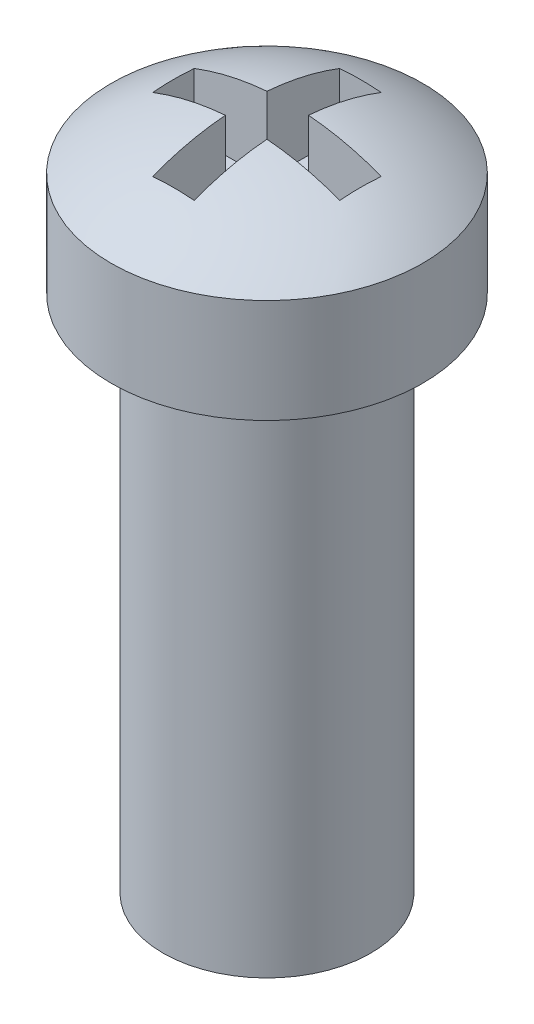
ISO-10303-21;
HEADER;
FILE_DESCRIPTION(('STEP AP214'),'2;1');
FILE_NAME('part.step','',(''),(''),'','','');
FILE_SCHEMA(('AUTOMOTIVE_DESIGN { 1 0 10303 214 1 1 1 1 }'));
ENDSEC;
DATA;
#1=APPLICATION_CONTEXT('core data for automotive mechanical design processes');
#2=APPLICATION_PROTOCOL_DEFINITION('international standard','automotive_design',2000,#1);
#3=PRODUCT_CONTEXT('',#1,'mechanical');
#4=PRODUCT('Part','Part','',(#3));
#5=PRODUCT_RELATED_PRODUCT_CATEGORY('part','',(#4));
#6=PRODUCT_DEFINITION_FORMATION('','',#4);
#7=PRODUCT_DEFINITION_CONTEXT('part definition',#1,'design');
#8=PRODUCT_DEFINITION('design','',#6,#7);
#9=PRODUCT_DEFINITION_SHAPE('','',#8);
#10=(LENGTH_UNIT() NAMED_UNIT(*) SI_UNIT(.MILLI.,.METRE.));
#11=(NAMED_UNIT(*) PLANE_ANGLE_UNIT() SI_UNIT($,.RADIAN.));
#12=(NAMED_UNIT(*) SI_UNIT($,.STERADIAN.) SOLID_ANGLE_UNIT());
#13=UNCERTAINTY_MEASURE_WITH_UNIT(LENGTH_MEASURE(1.E-05),#10,'distance_accuracy_value','');
#14=(GEOMETRIC_REPRESENTATION_CONTEXT(3) GLOBAL_UNCERTAINTY_ASSIGNED_CONTEXT((#13)) GLOBAL_UNIT_ASSIGNED_CONTEXT((#10,
#11,#12)) REPRESENTATION_CONTEXT('',''));
#15=CARTESIAN_POINT('',(0.,0.,0.));
#16=DIRECTION('',(0.,0.,1.));
#17=DIRECTION('',(1.,0.,0.));
#18=AXIS2_PLACEMENT_3D('',#15,#16,#17);
#19=CARTESIAN_POINT('',(0.,5.,0.));
#20=DIRECTION('',(0.,-1.,0.));
#21=DIRECTION('',(0.,0.,-1.));
#22=AXIS2_PLACEMENT_3D('',#19,#20,#21);
#23=CYLINDRICAL_SURFACE('',#22,1.);
#24=CARTESIAN_POINT('',(0.,5.,0.));
#25=DIRECTION('',(0.,1.,0.));
#26=DIRECTION('',(0.,0.,1.));
#27=AXIS2_PLACEMENT_3D('',#24,#25,#26);
#28=CIRCLE('',#27,1.);
#29=CARTESIAN_POINT('',(0.,5.,1.));
#30=VERTEX_POINT('',#29);
#31=EDGE_CURVE('E197',#30,#30,#28,.T.);
#32=ORIENTED_EDGE('',*,*,#31,.F.);
#33=EDGE_LOOP('',(#32));
#34=FACE_BOUND('',#33,.T.);
#35=CARTESIAN_POINT('',(0.,0.,0.));
#36=DIRECTION('',(0.,1.,0.));
#37=DIRECTION('',(0.,0.,1.));
#38=AXIS2_PLACEMENT_3D('',#35,#36,#37);
#39=CIRCLE('',#38,1.);
#40=CARTESIAN_POINT('',(0.,0.,1.));
#41=VERTEX_POINT('',#40);
#42=EDGE_CURVE('E201',#41,#41,#39,.T.);
#43=ORIENTED_EDGE('',*,*,#42,.T.);
#44=EDGE_LOOP('',(#43));
#45=FACE_BOUND('',#44,.T.);
#46=ADVANCED_FACE('F34',(#34,#45),#23,.T.);
#47=CARTESIAN_POINT('',(0.,0.,0.));
#48=DIRECTION('',(0.,1.,0.));
#49=DIRECTION('',(0.,0.,1.));
#50=AXIS2_PLACEMENT_3D('',#47,#48,#49);
#51=PLANE('',#50);
#52=ORIENTED_EDGE('',*,*,#42,.F.);
#53=EDGE_LOOP('',(#52));
#54=FACE_BOUND('',#53,.T.);
#55=ADVANCED_FACE('F275',(#54),#51,.F.);
#56=CARTESIAN_POINT('',(0.,6.,0.));
#57=DIRECTION('',(0.,-1.,0.));
#58=DIRECTION('',(0.,0.,-1.));
#59=AXIS2_PLACEMENT_3D('',#56,#57,#58);
#60=CYLINDRICAL_SURFACE('',#59,1.5);
#61=CARTESIAN_POINT('',(0.,6.,0.));
#62=DIRECTION('',(0.,1.,0.));
#63=DIRECTION('',(0.,0.,1.));
#64=AXIS2_PLACEMENT_3D('',#61,#62,#63);
#65=CIRCLE('',#64,1.5);
#66=CARTESIAN_POINT('',(0.,6.,1.5));
#67=VERTEX_POINT('',#66);
#68=EDGE_CURVE('E196',#67,#67,#65,.T.);
#69=ORIENTED_EDGE('',*,*,#68,.F.);
#70=EDGE_LOOP('',(#69));
#71=FACE_BOUND('',#70,.T.);
#72=CARTESIAN_POINT('',(0.,5.,0.));
#73=DIRECTION('',(0.,1.,0.));
#74=DIRECTION('',(0.,0.,1.));
#75=AXIS2_PLACEMENT_3D('',#72,#73,#74);
#76=CIRCLE('',#75,1.5);
#77=CARTESIAN_POINT('',(0.,5.,1.5));
#78=VERTEX_POINT('',#77);
#79=EDGE_CURVE('E166',#78,#78,#76,.T.);
#80=ORIENTED_EDGE('',*,*,#79,.T.);
#81=EDGE_LOOP('',(#80));
#82=FACE_BOUND('',#81,.T.);
#83=ADVANCED_FACE('F280',(#71,#82),#60,.T.);
#84=CARTESIAN_POINT('',(0.,4.,0.));
#85=DIRECTION('',(0.,0.,1.));
#86=DIRECTION('',(1.,0.,0.));
#87=AXIS2_PLACEMENT_3D('',#84,#85,#86);
#88=SPHERICAL_SURFACE('',#87,2.5);
#89=CARTESIAN_POINT('',(0.,4.,0.2));
#90=DIRECTION('',(0.,0.,1.));
#91=DIRECTION('',(1.,0.,0.));
#92=AXIS2_PLACEMENT_3D('',#89,#90,#91);
#93=CIRCLE('',#92,2.49198715887542);
#94=CARTESIAN_POINT('',(-0.9,6.32379000772445,0.2));
#95=VERTEX_POINT('',#94);
#96=CARTESIAN_POINT('',(-0.2,6.48394846967485,0.2));
#97=VERTEX_POINT('',#96);
#98=EDGE_CURVE('E11',#95,#97,#93,.F.);
#99=ORIENTED_EDGE('',*,*,#98,.F.);
#100=CARTESIAN_POINT('',(-0.9,4.,0.));
#101=DIRECTION('',(-1.,0.,0.));
#102=DIRECTION('',(0.,0.,1.));
#103=AXIS2_PLACEMENT_3D('',#100,#101,#102);
#104=CIRCLE('',#103,2.33238075793812);
#105=CARTESIAN_POINT('',(-0.9,6.32379000772445,-0.2));
#106=VERTEX_POINT('',#105);
#107=EDGE_CURVE('E42',#106,#95,#104,.F.);
#108=ORIENTED_EDGE('',*,*,#107,.F.);
#109=CARTESIAN_POINT('',(0.,4.,-0.2));
#110=DIRECTION('',(0.,0.,1.));
#111=DIRECTION('',(1.,0.,0.));
#112=AXIS2_PLACEMENT_3D('',#109,#110,#111);
#113=CIRCLE('',#112,2.49198715887542);
#114=CARTESIAN_POINT('',(-0.2,6.48394846967485,-0.2));
#115=VERTEX_POINT('',#114);
#116=EDGE_CURVE('E228',#106,#115,#113,.F.);
#117=ORIENTED_EDGE('',*,*,#116,.T.);
#118=CARTESIAN_POINT('',(-0.2,4.,0.));
#119=DIRECTION('',(-1.,0.,0.));
#120=DIRECTION('',(0.,0.,1.));
#121=AXIS2_PLACEMENT_3D('',#118,#119,#120);
#122=CIRCLE('',#121,2.49198715887542);
#123=CARTESIAN_POINT('',(-0.2,6.32379000772445,-0.9));
#124=VERTEX_POINT('',#123);
#125=EDGE_CURVE('E226',#124,#115,#122,.F.);
#126=ORIENTED_EDGE('',*,*,#125,.F.);
#127=CARTESIAN_POINT('',(0.,4.,-0.9));
#128=DIRECTION('',(0.,0.,1.));
#129=DIRECTION('',(1.,0.,0.));
#130=AXIS2_PLACEMENT_3D('',#127,#128,#129);
#131=CIRCLE('',#130,2.33238075793812);
#132=CARTESIAN_POINT('',(0.2,6.32379000772445,-0.9));
#133=VERTEX_POINT('',#132);
#134=EDGE_CURVE('E223',#124,#133,#131,.F.);
#135=ORIENTED_EDGE('',*,*,#134,.T.);
#136=CARTESIAN_POINT('',(0.2,4.,0.));
#137=DIRECTION('',(-1.,0.,0.));
#138=DIRECTION('',(0.,0.,1.));
#139=AXIS2_PLACEMENT_3D('',#136,#137,#138);
#140=CIRCLE('',#139,2.49198715887542);
#141=CARTESIAN_POINT('',(0.2,6.48394846967485,-0.2));
#142=VERTEX_POINT('',#141);
#143=EDGE_CURVE('E220',#133,#142,#140,.F.);
#144=ORIENTED_EDGE('',*,*,#143,.T.);
#145=CARTESIAN_POINT('',(0.,4.,-0.2));
#146=DIRECTION('',(0.,0.,1.));
#147=DIRECTION('',(1.,0.,0.));
#148=AXIS2_PLACEMENT_3D('',#145,#146,#147);
#149=CIRCLE('',#148,2.49198715887542);
#150=CARTESIAN_POINT('',(0.9,6.32379000772445,-0.2));
#151=VERTEX_POINT('',#150);
#152=EDGE_CURVE('E217',#142,#151,#149,.F.);
#153=ORIENTED_EDGE('',*,*,#152,.T.);
#154=CARTESIAN_POINT('',(0.9,4.,0.));
#155=DIRECTION('',(-1.,0.,0.));
#156=DIRECTION('',(0.,0.,1.));
#157=AXIS2_PLACEMENT_3D('',#154,#155,#156);
#158=CIRCLE('',#157,2.33238075793812);
#159=CARTESIAN_POINT('',(0.9,6.32379000772445,0.2));
#160=VERTEX_POINT('',#159);
#161=EDGE_CURVE('E214',#151,#160,#158,.F.);
#162=ORIENTED_EDGE('',*,*,#161,.T.);
#163=CARTESIAN_POINT('',(0.,4.,0.2));
#164=DIRECTION('',(0.,0.,1.));
#165=DIRECTION('',(1.,0.,0.));
#166=AXIS2_PLACEMENT_3D('',#163,#164,#165);
#167=CIRCLE('',#166,2.49198715887542);
#168=CARTESIAN_POINT('',(0.2,6.48394846967485,0.2));
#169=VERTEX_POINT('',#168);
#170=EDGE_CURVE('E212',#169,#160,#167,.F.);
#171=ORIENTED_EDGE('',*,*,#170,.F.);
#172=CARTESIAN_POINT('',(0.2,4.,0.));
#173=DIRECTION('',(-1.,0.,0.));
#174=DIRECTION('',(0.,0.,1.));
#175=AXIS2_PLACEMENT_3D('',#172,#173,#174);
#176=CIRCLE('',#175,2.49198715887542);
#177=CARTESIAN_POINT('',(0.2,6.32379000772445,0.9));
#178=VERTEX_POINT('',#177);
#179=EDGE_CURVE('E209',#169,#178,#176,.F.);
#180=ORIENTED_EDGE('',*,*,#179,.T.);
#181=CARTESIAN_POINT('',(0.,4.,0.9));
#182=DIRECTION('',(0.,0.,1.));
#183=DIRECTION('',(1.,0.,0.));
#184=AXIS2_PLACEMENT_3D('',#181,#182,#183);
#185=CIRCLE('',#184,2.33238075793812);
#186=CARTESIAN_POINT('',(-0.2,6.32379000772445,0.9));
#187=VERTEX_POINT('',#186);
#188=EDGE_CURVE('E207',#187,#178,#185,.F.);
#189=ORIENTED_EDGE('',*,*,#188,.F.);
#190=CARTESIAN_POINT('',(-0.2,4.,0.));
#191=DIRECTION('',(-1.,0.,0.));
#192=DIRECTION('',(0.,0.,1.));
#193=AXIS2_PLACEMENT_3D('',#190,#191,#192);
#194=CIRCLE('',#193,2.49198715887542);
#195=EDGE_CURVE('E200',#97,#187,#194,.F.);
#196=ORIENTED_EDGE('',*,*,#195,.F.);
#197=EDGE_LOOP('',(#99,#108,#117,#126,#135,#144,#153,#162,#171,#180,#189,#196));
#198=FACE_BOUND('',#197,.T.);
#199=ORIENTED_EDGE('',*,*,#68,.T.);
#200=EDGE_LOOP('',(#199));
#201=FACE_BOUND('',#200,.T.);
#202=ADVANCED_FACE('F36',(#198,#201),#88,.T.);
#203=CARTESIAN_POINT('',(0.,5.,0.));
#204=DIRECTION('',(0.,1.,0.));
#205=DIRECTION('',(0.,0.,1.));
#206=AXIS2_PLACEMENT_3D('',#203,#204,#205);
#207=PLANE('',#206);
#208=ORIENTED_EDGE('',*,*,#31,.T.);
#209=EDGE_LOOP('',(#208));
#210=FACE_BOUND('',#209,.T.);
#211=ORIENTED_EDGE('',*,*,#79,.F.);
#212=EDGE_LOOP('',(#211));
#213=FACE_BOUND('',#212,.T.);
#214=ADVANCED_FACE('F289',(#210,#213),#207,.F.);
#215=CARTESIAN_POINT('',(0.,5.75,0.2));
#216=DIRECTION('',(0.,0.,1.));
#217=DIRECTION('',(1.,0.,0.));
#218=AXIS2_PLACEMENT_3D('',#215,#216,#217);
#219=PLANE('',#218);
#220=ORIENTED_EDGE('',*,*,#98,.T.);
#221=DIRECTION('',(0.,1.,0.));
#222=VECTOR('',#221,1.);
#223=CARTESIAN_POINT('',(-0.2,5.75,0.2));
#224=LINE('',#223,#222);
#225=CARTESIAN_POINT('',(-0.2,5.75,0.2));
#226=VERTEX_POINT('',#225);
#227=EDGE_CURVE('E49',#226,#97,#224,.T.);
#228=ORIENTED_EDGE('',*,*,#227,.F.);
#229=DIRECTION('',(1.,0.,0.));
#230=VECTOR('',#229,1.);
#231=CARTESIAN_POINT('',(0.,5.75,0.2));
#232=LINE('',#231,#230);
#233=CARTESIAN_POINT('',(-0.9,5.75,0.2));
#234=VERTEX_POINT('',#233);
#235=EDGE_CURVE('E123',#234,#226,#232,.T.);
#236=ORIENTED_EDGE('',*,*,#235,.F.);
#237=DIRECTION('',(0.,1.,0.));
#238=VECTOR('',#237,1.);
#239=CARTESIAN_POINT('',(-0.9,5.75,0.2));
#240=LINE('',#239,#238);
#241=EDGE_CURVE('E164',#234,#95,#240,.T.);
#242=ORIENTED_EDGE('',*,*,#241,.T.);
#243=EDGE_LOOP('',(#220,#228,#236,#242));
#244=FACE_BOUND('',#243,.T.);
#245=ADVANCED_FACE('F121',(#244),#219,.F.);
#246=CARTESIAN_POINT('',(-0.9,5.75,0.));
#247=DIRECTION('',(-1.,0.,0.));
#248=DIRECTION('',(0.,0.,1.));
#249=AXIS2_PLACEMENT_3D('',#246,#247,#248);
#250=PLANE('',#249);
#251=ORIENTED_EDGE('',*,*,#107,.T.);
#252=ORIENTED_EDGE('',*,*,#241,.F.);
#253=DIRECTION('',(0.,0.,1.));
#254=VECTOR('',#253,1.);
#255=CARTESIAN_POINT('',(-0.9,5.75,0.));
#256=LINE('',#255,#254);
#257=CARTESIAN_POINT('',(-0.9,5.75,-0.2));
#258=VERTEX_POINT('',#257);
#259=EDGE_CURVE('E128',#258,#234,#256,.T.);
#260=ORIENTED_EDGE('',*,*,#259,.F.);
#261=DIRECTION('',(0.,1.,0.));
#262=VECTOR('',#261,1.);
#263=CARTESIAN_POINT('',(-0.9,5.75,-0.2));
#264=LINE('',#263,#262);
#265=EDGE_CURVE('E167',#258,#106,#264,.T.);
#266=ORIENTED_EDGE('',*,*,#265,.T.);
#267=EDGE_LOOP('',(#251,#252,#260,#266));
#268=FACE_BOUND('',#267,.T.);
#269=ADVANCED_FACE('F236',(#268),#250,.F.);
#270=CARTESIAN_POINT('',(0.,5.75,-0.2));
#271=DIRECTION('',(0.,0.,1.));
#272=DIRECTION('',(1.,0.,0.));
#273=AXIS2_PLACEMENT_3D('',#270,#271,#272);
#274=PLANE('',#273);
#275=ORIENTED_EDGE('',*,*,#265,.F.);
#276=DIRECTION('',(1.,0.,0.));
#277=VECTOR('',#276,1.);
#278=CARTESIAN_POINT('',(0.,5.75,-0.2));
#279=LINE('',#278,#277);
#280=CARTESIAN_POINT('',(-0.2,5.75,-0.2));
#281=VERTEX_POINT('',#280);
#282=EDGE_CURVE('E161',#258,#281,#279,.T.);
#283=ORIENTED_EDGE('',*,*,#282,.T.);
#284=DIRECTION('',(0.,1.,0.));
#285=VECTOR('',#284,1.);
#286=CARTESIAN_POINT('',(-0.2,5.75,-0.2));
#287=LINE('',#286,#285);
#288=EDGE_CURVE('E169',#281,#115,#287,.T.);
#289=ORIENTED_EDGE('',*,*,#288,.T.);
#290=ORIENTED_EDGE('',*,*,#116,.F.);
#291=EDGE_LOOP('',(#275,#283,#289,#290));
#292=FACE_BOUND('',#291,.T.);
#293=ADVANCED_FACE('F234',(#292),#274,.T.);
#294=CARTESIAN_POINT('',(-0.2,5.75,0.));
#295=DIRECTION('',(-1.,0.,0.));
#296=DIRECTION('',(0.,0.,1.));
#297=AXIS2_PLACEMENT_3D('',#294,#295,#296);
#298=PLANE('',#297);
#299=ORIENTED_EDGE('',*,*,#125,.T.);
#300=ORIENTED_EDGE('',*,*,#288,.F.);
#301=DIRECTION('',(0.,0.,1.));
#302=VECTOR('',#301,1.);
#303=CARTESIAN_POINT('',(-0.2,5.75,0.));
#304=LINE('',#303,#302);
#305=CARTESIAN_POINT('',(-0.2,5.75,-0.9));
#306=VERTEX_POINT('',#305);
#307=EDGE_CURVE('E158',#306,#281,#304,.T.);
#308=ORIENTED_EDGE('',*,*,#307,.F.);
#309=DIRECTION('',(0.,1.,0.));
#310=VECTOR('',#309,1.);
#311=CARTESIAN_POINT('',(-0.2,5.75,-0.9));
#312=LINE('',#311,#310);
#313=EDGE_CURVE('E172',#306,#124,#312,.T.);
#314=ORIENTED_EDGE('',*,*,#313,.T.);
#315=EDGE_LOOP('',(#299,#300,#308,#314));
#316=FACE_BOUND('',#315,.T.);
#317=ADVANCED_FACE('F264',(#316),#298,.F.);
#318=CARTESIAN_POINT('',(0.,5.75,-0.9));
#319=DIRECTION('',(0.,0.,1.));
#320=DIRECTION('',(1.,0.,0.));
#321=AXIS2_PLACEMENT_3D('',#318,#319,#320);
#322=PLANE('',#321);
#323=ORIENTED_EDGE('',*,*,#313,.F.);
#324=DIRECTION('',(1.,0.,0.));
#325=VECTOR('',#324,1.);
#326=CARTESIAN_POINT('',(0.,5.75,-0.9));
#327=LINE('',#326,#325);
#328=CARTESIAN_POINT('',(0.2,5.75,-0.9));
#329=VERTEX_POINT('',#328);
#330=EDGE_CURVE('E156',#306,#329,#327,.T.);
#331=ORIENTED_EDGE('',*,*,#330,.T.);
#332=DIRECTION('',(0.,1.,0.));
#333=VECTOR('',#332,1.);
#334=CARTESIAN_POINT('',(0.2,5.75,-0.9));
#335=LINE('',#334,#333);
#336=EDGE_CURVE('E175',#329,#133,#335,.T.);
#337=ORIENTED_EDGE('',*,*,#336,.T.);
#338=ORIENTED_EDGE('',*,*,#134,.F.);
#339=EDGE_LOOP('',(#323,#331,#337,#338));
#340=FACE_BOUND('',#339,.T.);
#341=ADVANCED_FACE('F265',(#340),#322,.T.);
#342=CARTESIAN_POINT('',(0.2,5.75,0.));
#343=DIRECTION('',(-1.,0.,0.));
#344=DIRECTION('',(0.,0.,1.));
#345=AXIS2_PLACEMENT_3D('',#342,#343,#344);
#346=PLANE('',#345);
#347=ORIENTED_EDGE('',*,*,#336,.F.);
#348=DIRECTION('',(0.,0.,1.));
#349=VECTOR('',#348,1.);
#350=CARTESIAN_POINT('',(0.2,5.75,0.));
#351=LINE('',#350,#349);
#352=CARTESIAN_POINT('',(0.2,5.75,-0.2));
#353=VERTEX_POINT('',#352);
#354=EDGE_CURVE('E154',#329,#353,#351,.T.);
#355=ORIENTED_EDGE('',*,*,#354,.T.);
#356=DIRECTION('',(0.,1.,0.));
#357=VECTOR('',#356,1.);
#358=CARTESIAN_POINT('',(0.2,5.75,-0.2));
#359=LINE('',#358,#357);
#360=EDGE_CURVE('E178',#353,#142,#359,.T.);
#361=ORIENTED_EDGE('',*,*,#360,.T.);
#362=ORIENTED_EDGE('',*,*,#143,.F.);
#363=EDGE_LOOP('',(#347,#355,#361,#362));
#364=FACE_BOUND('',#363,.T.);
#365=ADVANCED_FACE('F258',(#364),#346,.T.);
#366=CARTESIAN_POINT('',(0.,5.75,-0.2));
#367=DIRECTION('',(0.,0.,1.));
#368=DIRECTION('',(1.,0.,0.));
#369=AXIS2_PLACEMENT_3D('',#366,#367,#368);
#370=PLANE('',#369);
#371=ORIENTED_EDGE('',*,*,#360,.F.);
#372=DIRECTION('',(1.,0.,0.));
#373=VECTOR('',#372,1.);
#374=CARTESIAN_POINT('',(0.,5.75,-0.2));
#375=LINE('',#374,#373);
#376=CARTESIAN_POINT('',(0.9,5.75,-0.2));
#377=VERTEX_POINT('',#376);
#378=EDGE_CURVE('E152',#353,#377,#375,.T.);
#379=ORIENTED_EDGE('',*,*,#378,.T.);
#380=DIRECTION('',(0.,1.,0.));
#381=VECTOR('',#380,1.);
#382=CARTESIAN_POINT('',(0.9,5.75,-0.2));
#383=LINE('',#382,#381);
#384=EDGE_CURVE('E181',#377,#151,#383,.T.);
#385=ORIENTED_EDGE('',*,*,#384,.T.);
#386=ORIENTED_EDGE('',*,*,#152,.F.);
#387=EDGE_LOOP('',(#371,#379,#385,#386));
#388=FACE_BOUND('',#387,.T.);
#389=ADVANCED_FACE('F254',(#388),#370,.T.);
#390=CARTESIAN_POINT('',(0.9,5.75,0.));
#391=DIRECTION('',(-1.,0.,0.));
#392=DIRECTION('',(0.,0.,1.));
#393=AXIS2_PLACEMENT_3D('',#390,#391,#392);
#394=PLANE('',#393);
#395=ORIENTED_EDGE('',*,*,#384,.F.);
#396=DIRECTION('',(0.,0.,1.));
#397=VECTOR('',#396,1.);
#398=CARTESIAN_POINT('',(0.9,5.75,0.));
#399=LINE('',#398,#397);
#400=CARTESIAN_POINT('',(0.9,5.75,0.2));
#401=VERTEX_POINT('',#400);
#402=EDGE_CURVE('E150',#377,#401,#399,.T.);
#403=ORIENTED_EDGE('',*,*,#402,.T.);
#404=DIRECTION('',(0.,1.,0.));
#405=VECTOR('',#404,1.);
#406=CARTESIAN_POINT('',(0.9,5.75,0.2));
#407=LINE('',#406,#405);
#408=EDGE_CURVE('E184',#401,#160,#407,.T.);
#409=ORIENTED_EDGE('',*,*,#408,.T.);
#410=ORIENTED_EDGE('',*,*,#161,.F.);
#411=EDGE_LOOP('',(#395,#403,#409,#410));
#412=FACE_BOUND('',#411,.T.);
#413=ADVANCED_FACE('F251',(#412),#394,.T.);
#414=CARTESIAN_POINT('',(0.,5.75,0.2));
#415=DIRECTION('',(0.,0.,1.));
#416=DIRECTION('',(1.,0.,0.));
#417=AXIS2_PLACEMENT_3D('',#414,#415,#416);
#418=PLANE('',#417);
#419=ORIENTED_EDGE('',*,*,#170,.T.);
#420=ORIENTED_EDGE('',*,*,#408,.F.);
#421=DIRECTION('',(1.,0.,0.));
#422=VECTOR('',#421,1.);
#423=CARTESIAN_POINT('',(0.,5.75,0.2));
#424=LINE('',#423,#422);
#425=CARTESIAN_POINT('',(0.2,5.75,0.2));
#426=VERTEX_POINT('',#425);
#427=EDGE_CURVE('E147',#426,#401,#424,.T.);
#428=ORIENTED_EDGE('',*,*,#427,.F.);
#429=DIRECTION('',(0.,1.,0.));
#430=VECTOR('',#429,1.);
#431=CARTESIAN_POINT('',(0.2,5.75,0.2));
#432=LINE('',#431,#430);
#433=EDGE_CURVE('E187',#426,#169,#432,.T.);
#434=ORIENTED_EDGE('',*,*,#433,.T.);
#435=EDGE_LOOP('',(#419,#420,#428,#434));
#436=FACE_BOUND('',#435,.T.);
#437=ADVANCED_FACE('F247',(#436),#418,.F.);
#438=CARTESIAN_POINT('',(0.2,5.75,0.));
#439=DIRECTION('',(-1.,0.,0.));
#440=DIRECTION('',(0.,0.,1.));
#441=AXIS2_PLACEMENT_3D('',#438,#439,#440);
#442=PLANE('',#441);
#443=ORIENTED_EDGE('',*,*,#433,.F.);
#444=DIRECTION('',(0.,0.,1.));
#445=VECTOR('',#444,1.);
#446=CARTESIAN_POINT('',(0.2,5.75,0.));
#447=LINE('',#446,#445);
#448=CARTESIAN_POINT('',(0.2,5.75,0.9));
#449=VERTEX_POINT('',#448);
#450=EDGE_CURVE('E145',#426,#449,#447,.T.);
#451=ORIENTED_EDGE('',*,*,#450,.T.);
#452=DIRECTION('',(0.,1.,0.));
#453=VECTOR('',#452,1.);
#454=CARTESIAN_POINT('',(0.2,5.75,0.9));
#455=LINE('',#454,#453);
#456=EDGE_CURVE('E190',#449,#178,#455,.T.);
#457=ORIENTED_EDGE('',*,*,#456,.T.);
#458=ORIENTED_EDGE('',*,*,#179,.F.);
#459=EDGE_LOOP('',(#443,#451,#457,#458));
#460=FACE_BOUND('',#459,.T.);
#461=ADVANCED_FACE('F299',(#460),#442,.T.);
#462=CARTESIAN_POINT('',(0.,5.75,0.9));
#463=DIRECTION('',(0.,0.,1.));
#464=DIRECTION('',(1.,0.,0.));
#465=AXIS2_PLACEMENT_3D('',#462,#463,#464);
#466=PLANE('',#465);
#467=ORIENTED_EDGE('',*,*,#188,.T.);
#468=ORIENTED_EDGE('',*,*,#456,.F.);
#469=DIRECTION('',(1.,0.,0.));
#470=VECTOR('',#469,1.);
#471=CARTESIAN_POINT('',(0.,5.75,0.9));
#472=LINE('',#471,#470);
#473=CARTESIAN_POINT('',(-0.2,5.75,0.9));
#474=VERTEX_POINT('',#473);
#475=EDGE_CURVE('E137',#474,#449,#472,.T.);
#476=ORIENTED_EDGE('',*,*,#475,.F.);
#477=DIRECTION('',(0.,1.,0.));
#478=VECTOR('',#477,1.);
#479=CARTESIAN_POINT('',(-0.2,5.75,0.9));
#480=LINE('',#479,#478);
#481=EDGE_CURVE('E127',#474,#187,#480,.T.);
#482=ORIENTED_EDGE('',*,*,#481,.T.);
#483=EDGE_LOOP('',(#467,#468,#476,#482));
#484=FACE_BOUND('',#483,.T.);
#485=ADVANCED_FACE('F239',(#484),#466,.F.);
#486=CARTESIAN_POINT('',(-0.2,5.75,0.));
#487=DIRECTION('',(-1.,0.,0.));
#488=DIRECTION('',(0.,0.,1.));
#489=AXIS2_PLACEMENT_3D('',#486,#487,#488);
#490=PLANE('',#489);
#491=ORIENTED_EDGE('',*,*,#195,.T.);
#492=ORIENTED_EDGE('',*,*,#481,.F.);
#493=DIRECTION('',(0.,0.,1.));
#494=VECTOR('',#493,1.);
#495=CARTESIAN_POINT('',(-0.2,5.75,0.));
#496=LINE('',#495,#494);
#497=EDGE_CURVE('E131',#226,#474,#496,.T.);
#498=ORIENTED_EDGE('',*,*,#497,.F.);
#499=ORIENTED_EDGE('',*,*,#227,.T.);
#500=EDGE_LOOP('',(#491,#492,#498,#499));
#501=FACE_BOUND('',#500,.T.);
#502=ADVANCED_FACE('F132',(#501),#490,.F.);
#503=CARTESIAN_POINT('',(0.,5.75,0.));
#504=DIRECTION('',(0.,1.,0.));
#505=DIRECTION('',(0.,0.,1.));
#506=AXIS2_PLACEMENT_3D('',#503,#504,#505);
#507=PLANE('',#506);
#508=ORIENTED_EDGE('',*,*,#235,.T.);
#509=ORIENTED_EDGE('',*,*,#497,.T.);
#510=ORIENTED_EDGE('',*,*,#475,.T.);
#511=ORIENTED_EDGE('',*,*,#450,.F.);
#512=ORIENTED_EDGE('',*,*,#427,.T.);
#513=ORIENTED_EDGE('',*,*,#402,.F.);
#514=ORIENTED_EDGE('',*,*,#378,.F.);
#515=ORIENTED_EDGE('',*,*,#354,.F.);
#516=ORIENTED_EDGE('',*,*,#330,.F.);
#517=ORIENTED_EDGE('',*,*,#307,.T.);
#518=ORIENTED_EDGE('',*,*,#282,.F.);
#519=ORIENTED_EDGE('',*,*,#259,.T.);
#520=EDGE_LOOP('',(#508,#509,#510,#511,#512,#513,#514,#515,#516,#517,#518,#519));
#521=FACE_BOUND('',#520,.T.);
#522=ADVANCED_FACE('F139',(#521),#507,.T.);
#523=CLOSED_SHELL('',(#46,#55,#83,#202,#214,#245,#269,#293,#317,#341,#365,#389,#413,#437,#461,
#485,#502,#522));
#524=MANIFOLD_SOLID_BREP('B2',#523);
#525=ADVANCED_BREP_SHAPE_REPRESENTATION('',(#18,#524),#14);
#526=SHAPE_DEFINITION_REPRESENTATION(#9,#525);
ENDSEC;
END-ISO-10303-21;
